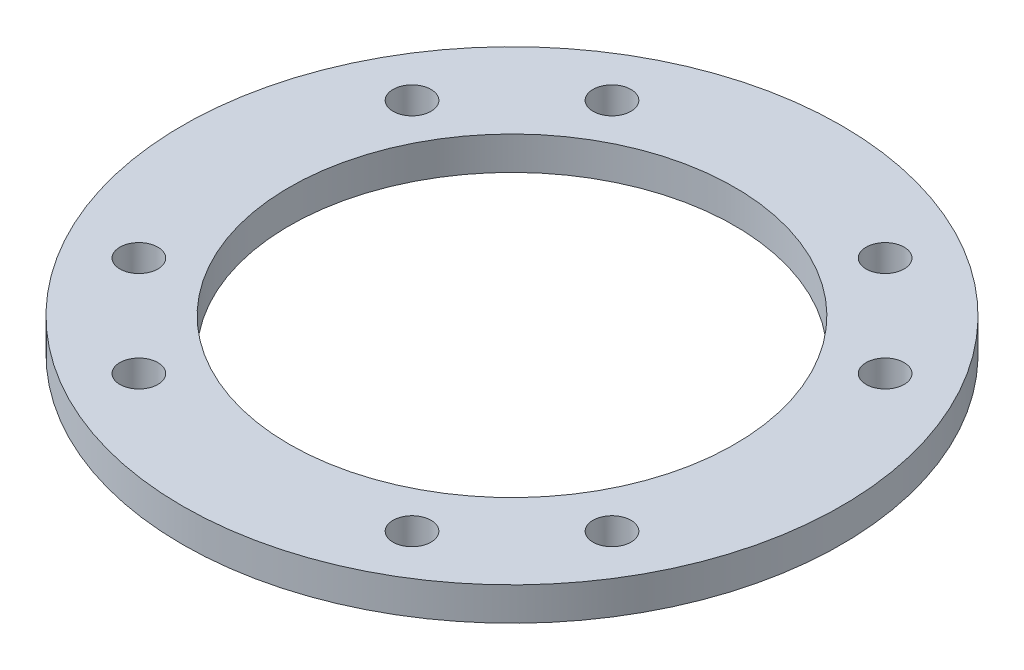
ISO-10303-21;
HEADER;
FILE_DESCRIPTION(('STEP AP214'),'2;1');
FILE_NAME('part.step','',(''),(''),'','','');
FILE_SCHEMA(('AUTOMOTIVE_DESIGN { 1 0 10303 214 1 1 1 1 }'));
ENDSEC;
DATA;
#1=APPLICATION_CONTEXT('core data for automotive mechanical design processes');
#2=APPLICATION_PROTOCOL_DEFINITION('international standard','automotive_design',2000,#1);
#3=PRODUCT_CONTEXT('',#1,'mechanical');
#4=PRODUCT('Part','Part','',(#3));
#5=PRODUCT_RELATED_PRODUCT_CATEGORY('part','',(#4));
#6=PRODUCT_DEFINITION_FORMATION('','',#4);
#7=PRODUCT_DEFINITION_CONTEXT('part definition',#1,'design');
#8=PRODUCT_DEFINITION('design','',#6,#7);
#9=PRODUCT_DEFINITION_SHAPE('','',#8);
#10=(LENGTH_UNIT() NAMED_UNIT(*) SI_UNIT(.MILLI.,.METRE.));
#11=(NAMED_UNIT(*) PLANE_ANGLE_UNIT() SI_UNIT($,.RADIAN.));
#12=(NAMED_UNIT(*) SI_UNIT($,.STERADIAN.) SOLID_ANGLE_UNIT());
#13=UNCERTAINTY_MEASURE_WITH_UNIT(LENGTH_MEASURE(1.E-05),#10,'distance_accuracy_value','');
#14=(GEOMETRIC_REPRESENTATION_CONTEXT(3) GLOBAL_UNCERTAINTY_ASSIGNED_CONTEXT((#13)) GLOBAL_UNIT_ASSIGNED_CONTEXT((#10,
#11,#12)) REPRESENTATION_CONTEXT('',''));
#15=CARTESIAN_POINT('',(0.,0.,0.));
#16=DIRECTION('',(0.,0.,1.));
#17=DIRECTION('',(1.,0.,0.));
#18=AXIS2_PLACEMENT_3D('',#15,#16,#17);
#19=CARTESIAN_POINT('',(0.,-40.6471311900001,0.));
#20=DIRECTION('',(0.,1.,0.));
#21=DIRECTION('',(0.,0.,1.));
#22=AXIS2_PLACEMENT_3D('',#19,#20,#21);
#23=PLANE('',#22);
#24=CARTESIAN_POINT('',(0.,-40.6471311900001,0.));
#25=DIRECTION('',(0.,1.,0.));
#26=DIRECTION('',(0.,0.,1.));
#27=AXIS2_PLACEMENT_3D('',#24,#25,#26);
#28=CIRCLE('',#27,37.5);
#29=CARTESIAN_POINT('',(0.,-40.6471311900001,37.5));
#30=VERTEX_POINT('',#29);
#31=EDGE_CURVE('E101',#30,#30,#28,.T.);
#32=ORIENTED_EDGE('',*,*,#31,.F.);
#33=EDGE_LOOP('',(#32));
#34=FACE_BOUND('',#33,.T.);
#35=CARTESIAN_POINT('',(0.,-40.6471311900001,0.));
#36=DIRECTION('',(0.,1.,0.));
#37=DIRECTION('',(0.,0.,1.));
#38=AXIS2_PLACEMENT_3D('',#35,#36,#37);
#39=CIRCLE('',#38,55.5);
#40=CARTESIAN_POINT('',(0.,-40.6471311900001,55.5));
#41=VERTEX_POINT('',#40);
#42=EDGE_CURVE('E10',#41,#41,#39,.T.);
#43=ORIENTED_EDGE('',*,*,#42,.T.);
#44=EDGE_LOOP('',(#43));
#45=FACE_BOUND('',#44,.T.);
#46=CARTESIAN_POINT('',(-22.9999999999995,-40.6471311900001,-39.8371685740845));
#47=DIRECTION('',(0.,-1.,0.));
#48=DIRECTION('',(0.,0.,-1.));
#49=AXIS2_PLACEMENT_3D('',#46,#47,#48);
#50=CIRCLE('',#49,3.20000000000001);
#51=CARTESIAN_POINT('',(-22.9999999999995,-40.6471311900001,-43.0371685740845));
#52=VERTEX_POINT('',#51);
#53=EDGE_CURVE('E90',#52,#52,#50,.F.);
#54=ORIENTED_EDGE('',*,*,#53,.F.);
#55=EDGE_LOOP('',(#54));
#56=FACE_BOUND('',#55,.T.);
#57=CARTESIAN_POINT('',(-39.8371685740839,-40.6471311900001,-23.0000000000005));
#58=DIRECTION('',(0.,-1.,0.));
#59=DIRECTION('',(0.,0.,-1.));
#60=AXIS2_PLACEMENT_3D('',#57,#58,#59);
#61=CIRCLE('',#60,3.20000000000001);
#62=CARTESIAN_POINT('',(-39.8371685740839,-40.6471311900001,-26.2000000000005));
#63=VERTEX_POINT('',#62);
#64=EDGE_CURVE('E84',#63,#63,#61,.F.);
#65=ORIENTED_EDGE('',*,*,#64,.F.);
#66=EDGE_LOOP('',(#65));
#67=FACE_BOUND('',#66,.T.);
#68=CARTESIAN_POINT('',(-39.8371685740842,-40.6471311900001,22.9999999999999));
#69=DIRECTION('',(0.,-1.,0.));
#70=DIRECTION('',(0.,0.,-1.));
#71=AXIS2_PLACEMENT_3D('',#68,#69,#70);
#72=CIRCLE('',#71,3.20000000000001);
#73=CARTESIAN_POINT('',(-39.8371685740842,-40.6471311900001,19.7999999999999));
#74=VERTEX_POINT('',#73);
#75=EDGE_CURVE('E78',#74,#74,#72,.F.);
#76=ORIENTED_EDGE('',*,*,#75,.F.);
#77=EDGE_LOOP('',(#76));
#78=FACE_BOUND('',#77,.T.);
#79=CARTESIAN_POINT('',(-23.,-40.6471311900001,39.8371685740842));
#80=DIRECTION('',(0.,-1.,0.));
#81=DIRECTION('',(0.,0.,-1.));
#82=AXIS2_PLACEMENT_3D('',#79,#80,#81);
#83=CIRCLE('',#82,3.20000000000001);
#84=CARTESIAN_POINT('',(-19.8,-40.6471311900001,39.8371685740842));
#85=VERTEX_POINT('',#84);
#86=EDGE_CURVE('E72',#85,#85,#83,.F.);
#87=ORIENTED_EDGE('',*,*,#86,.F.);
#88=EDGE_LOOP('',(#87));
#89=FACE_BOUND('',#88,.T.);
#90=CARTESIAN_POINT('',(22.9999999999998,-40.6471311900001,39.8371685740843));
#91=DIRECTION('',(0.,-1.,0.));
#92=DIRECTION('',(0.,0.,-1.));
#93=AXIS2_PLACEMENT_3D('',#90,#91,#92);
#94=CIRCLE('',#93,3.20000000000001);
#95=CARTESIAN_POINT('',(22.9999999999998,-40.6471311900001,36.6371685740843));
#96=VERTEX_POINT('',#95);
#97=EDGE_CURVE('E66',#96,#96,#94,.F.);
#98=ORIENTED_EDGE('',*,*,#97,.F.);
#99=EDGE_LOOP('',(#98));
#100=FACE_BOUND('',#99,.T.);
#101=CARTESIAN_POINT('',(39.8371685740841,-40.6471311900001,23.0000000000002));
#102=DIRECTION('',(0.,-1.,0.));
#103=DIRECTION('',(0.,0.,-1.));
#104=AXIS2_PLACEMENT_3D('',#101,#102,#103);
#105=CIRCLE('',#104,3.20000000000001);
#106=CARTESIAN_POINT('',(39.8371685740841,-40.6471311900001,19.8000000000002));
#107=VERTEX_POINT('',#106);
#108=EDGE_CURVE('E60',#107,#107,#105,.F.);
#109=ORIENTED_EDGE('',*,*,#108,.F.);
#110=EDGE_LOOP('',(#109));
#111=FACE_BOUND('',#110,.T.);
#112=CARTESIAN_POINT('',(39.8371685740843,-40.6471311900001,-22.9999999999999));
#113=DIRECTION('',(0.,-1.,0.));
#114=DIRECTION('',(0.,0.,-1.));
#115=AXIS2_PLACEMENT_3D('',#112,#113,#114);
#116=CIRCLE('',#115,3.20000000000001);
#117=CARTESIAN_POINT('',(39.8371685740843,-40.6471311900001,-26.1999999999999));
#118=VERTEX_POINT('',#117);
#119=EDGE_CURVE('E55',#118,#118,#116,.F.);
#120=ORIENTED_EDGE('',*,*,#119,.F.);
#121=EDGE_LOOP('',(#120));
#122=FACE_BOUND('',#121,.T.);
#123=CARTESIAN_POINT('',(23.0000000000001,-40.6471311900001,-39.8371685740842));
#124=DIRECTION('',(0.,-1.,0.));
#125=DIRECTION('',(0.,0.,-1.));
#126=AXIS2_PLACEMENT_3D('',#123,#124,#125);
#127=CIRCLE('',#126,3.20000000000001);
#128=CARTESIAN_POINT('',(23.0000000000001,-40.6471311900001,-43.0371685740842));
#129=VERTEX_POINT('',#128);
#130=EDGE_CURVE('E47',#129,#129,#127,.F.);
#131=ORIENTED_EDGE('',*,*,#130,.F.);
#132=EDGE_LOOP('',(#131));
#133=FACE_BOUND('',#132,.T.);
#134=ADVANCED_FACE('F37',(#34,#45,#56,#67,#78,#89,#100,#111,#122,#133),#23,.T.);
#135=CARTESIAN_POINT('',(55.5,-46.25,0.));
#136=DIRECTION('',(0.,1.,0.));
#137=DIRECTION('',(0.,0.,1.));
#138=AXIS2_PLACEMENT_3D('',#135,#136,#137);
#139=PLANE('',#138);
#140=CARTESIAN_POINT('',(0.,-46.25,0.));
#141=DIRECTION('',(0.,1.,0.));
#142=DIRECTION('',(0.,0.,1.));
#143=AXIS2_PLACEMENT_3D('',#140,#141,#142);
#144=CIRCLE('',#143,37.5);
#145=CARTESIAN_POINT('',(0.,-46.25,37.5));
#146=VERTEX_POINT('',#145);
#147=EDGE_CURVE('E96',#146,#146,#144,.F.);
#148=ORIENTED_EDGE('',*,*,#147,.F.);
#149=EDGE_LOOP('',(#148));
#150=FACE_BOUND('',#149,.T.);
#151=CARTESIAN_POINT('',(-22.9999999999995,-46.25,-39.8371685740845));
#152=DIRECTION('',(0.,-1.,0.));
#153=DIRECTION('',(0.50000000000001,0.,-0.866025403784433));
#154=AXIS2_PLACEMENT_3D('',#151,#152,#153);
#155=CIRCLE('',#154,3.20000000000001);
#156=CARTESIAN_POINT('',(-21.3999999999994,-46.25,-42.6084498661947));
#157=VERTEX_POINT('',#156);
#158=EDGE_CURVE('E93',#157,#157,#155,.T.);
#159=ORIENTED_EDGE('',*,*,#158,.F.);
#160=EDGE_LOOP('',(#159));
#161=FACE_BOUND('',#160,.T.);
#162=CARTESIAN_POINT('',(-39.8371685740839,-46.25,-23.0000000000005));
#163=DIRECTION('',(0.,-1.,0.));
#164=DIRECTION('',(0.,0.,-1.));
#165=AXIS2_PLACEMENT_3D('',#162,#163,#164);
#166=CIRCLE('',#165,3.20000000000001);
#167=CARTESIAN_POINT('',(-39.8371685740839,-46.25,-26.2000000000005));
#168=VERTEX_POINT('',#167);
#169=EDGE_CURVE('E87',#168,#168,#166,.T.);
#170=ORIENTED_EDGE('',*,*,#169,.F.);
#171=EDGE_LOOP('',(#170));
#172=FACE_BOUND('',#171,.T.);
#173=CARTESIAN_POINT('',(-39.8371685740842,-46.25,22.9999999999999));
#174=DIRECTION('',(0.,-1.,0.));
#175=DIRECTION('',(-0.866025403784438,0.,-0.500000000000001));
#176=AXIS2_PLACEMENT_3D('',#173,#174,#175);
#177=CIRCLE('',#176,3.20000000000001);
#178=CARTESIAN_POINT('',(-42.6084498661944,-46.25,21.3999999999999));
#179=VERTEX_POINT('',#178);
#180=EDGE_CURVE('E81',#179,#179,#177,.T.);
#181=ORIENTED_EDGE('',*,*,#180,.F.);
#182=EDGE_LOOP('',(#181));
#183=FACE_BOUND('',#182,.T.);
#184=CARTESIAN_POINT('',(-23.,-46.25,39.8371685740842));
#185=DIRECTION('',(0.,-1.,0.));
#186=DIRECTION('',(-1.,0.,0.));
#187=AXIS2_PLACEMENT_3D('',#184,#185,#186);
#188=CIRCLE('',#187,3.20000000000001);
#189=CARTESIAN_POINT('',(-19.8,-46.25,39.8371685740842));
#190=VERTEX_POINT('',#189);
#191=EDGE_CURVE('E75',#190,#190,#188,.T.);
#192=ORIENTED_EDGE('',*,*,#191,.F.);
#193=EDGE_LOOP('',(#192));
#194=FACE_BOUND('',#193,.T.);
#195=CARTESIAN_POINT('',(22.9999999999998,-46.25,39.8371685740843));
#196=DIRECTION('',(0.,-1.,0.));
#197=DIRECTION('',(-0.500000000000004,0.,0.866025403784436));
#198=AXIS2_PLACEMENT_3D('',#195,#196,#197);
#199=CIRCLE('',#198,3.20000000000001);
#200=CARTESIAN_POINT('',(21.3999999999998,-46.25,42.6084498661945));
#201=VERTEX_POINT('',#200);
#202=EDGE_CURVE('E69',#201,#201,#199,.T.);
#203=ORIENTED_EDGE('',*,*,#202,.F.);
#204=EDGE_LOOP('',(#203));
#205=FACE_BOUND('',#204,.T.);
#206=CARTESIAN_POINT('',(39.8371685740841,-46.25,23.0000000000002));
#207=DIRECTION('',(0.,-1.,0.));
#208=DIRECTION('',(0.,0.,1.));
#209=AXIS2_PLACEMENT_3D('',#206,#207,#208);
#210=CIRCLE('',#209,3.20000000000001);
#211=CARTESIAN_POINT('',(39.8371685740841,-46.25,26.2000000000002));
#212=VERTEX_POINT('',#211);
#213=EDGE_CURVE('E63',#212,#212,#210,.T.);
#214=ORIENTED_EDGE('',*,*,#213,.F.);
#215=EDGE_LOOP('',(#214));
#216=FACE_BOUND('',#215,.T.);
#217=CARTESIAN_POINT('',(39.8371685740843,-46.25,-22.9999999999999));
#218=DIRECTION('',(0.,-1.,0.));
#219=DIRECTION('',(0.866025403784438,0.,0.500000000000001));
#220=AXIS2_PLACEMENT_3D('',#217,#218,#219);
#221=CIRCLE('',#220,3.20000000000001);
#222=CARTESIAN_POINT('',(42.6084498661945,-46.25,-21.3999999999999));
#223=VERTEX_POINT('',#222);
#224=EDGE_CURVE('E57',#223,#223,#221,.T.);
#225=ORIENTED_EDGE('',*,*,#224,.F.);
#226=EDGE_LOOP('',(#225));
#227=FACE_BOUND('',#226,.T.);
#228=CARTESIAN_POINT('',(23.0000000000001,-46.25,-39.8371685740842));
#229=DIRECTION('',(0.,-1.,0.));
#230=DIRECTION('',(1.,0.,0.));
#231=AXIS2_PLACEMENT_3D('',#228,#229,#230);
#232=CIRCLE('',#231,3.20000000000001);
#233=CARTESIAN_POINT('',(26.2000000000001,-46.25,-39.8371685740842));
#234=VERTEX_POINT('',#233);
#235=EDGE_CURVE('E51',#234,#234,#232,.T.);
#236=ORIENTED_EDGE('',*,*,#235,.F.);
#237=EDGE_LOOP('',(#236));
#238=FACE_BOUND('',#237,.T.);
#239=CARTESIAN_POINT('',(0.,-46.25,0.));
#240=DIRECTION('',(0.,1.,0.));
#241=DIRECTION('',(0.,0.,1.));
#242=AXIS2_PLACEMENT_3D('',#239,#240,#241);
#243=CIRCLE('',#242,55.5);
#244=CARTESIAN_POINT('',(0.,-46.25,55.5));
#245=VERTEX_POINT('',#244);
#246=EDGE_CURVE('E43',#245,#245,#243,.T.);
#247=ORIENTED_EDGE('',*,*,#246,.F.);
#248=EDGE_LOOP('',(#247));
#249=FACE_BOUND('',#248,.T.);
#250=ADVANCED_FACE('F109',(#150,#161,#172,#183,#194,#205,#216,#227,#238,#249),#139,.F.);
#251=CARTESIAN_POINT('',(0.,-40.25,0.));
#252=DIRECTION('',(0.,1.,0.));
#253=DIRECTION('',(0.,0.,1.));
#254=AXIS2_PLACEMENT_3D('',#251,#252,#253);
#255=CYLINDRICAL_SURFACE('',#254,55.5);
#256=ORIENTED_EDGE('',*,*,#42,.F.);
#257=EDGE_LOOP('',(#256));
#258=FACE_BOUND('',#257,.T.);
#259=ORIENTED_EDGE('',*,*,#246,.T.);
#260=EDGE_LOOP('',(#259));
#261=FACE_BOUND('',#260,.T.);
#262=ADVANCED_FACE('F146',(#258,#261),#255,.T.);
#263=CARTESIAN_POINT('',(-23.0000000000001,0.00100000000036876,39.8371685740842));
#264=DIRECTION('',(0.,-1.,0.));
#265=DIRECTION('',(1.,0.,0.));
#266=AXIS2_PLACEMENT_3D('',#263,#264,#265);
#267=CYLINDRICAL_SURFACE('',#266,3.20000000000001);
#268=CARTESIAN_POINT('',(-19.8,-46.25,39.8371685740842));
#269=CARTESIAN_POINT('',(-19.8,-46.1916367832292,39.8371685740842));
#270=CARTESIAN_POINT('',(-19.8,-46.1332735664584,39.8371685740842));
#271=CARTESIAN_POINT('',(-19.8,-46.0165471329167,39.8371685740842));
#272=CARTESIAN_POINT('',(-19.8,-45.9581839161459,39.8371685740842));
#273=CARTESIAN_POINT('',(-19.8,-45.8414574826042,39.8371685740842));
#274=CARTESIAN_POINT('',(-19.8,-45.7830942658334,39.8371685740842));
#275=CARTESIAN_POINT('',(-19.8,-45.6663678322917,39.8371685740842));
#276=CARTESIAN_POINT('',(-19.8,-45.6080046155209,39.8371685740842));
#277=CARTESIAN_POINT('',(-19.8,-45.4912781819792,39.8371685740842));
#278=CARTESIAN_POINT('',(-19.8,-45.4329149652084,39.8371685740842));
#279=CARTESIAN_POINT('',(-19.8,-45.3161885316667,39.8371685740842));
#280=CARTESIAN_POINT('',(-19.8,-45.2578253148959,39.8371685740842));
#281=CARTESIAN_POINT('',(-19.8,-45.1410988813542,39.8371685740842));
#282=CARTESIAN_POINT('',(-19.8,-45.0827356645834,39.8371685740842));
#283=CARTESIAN_POINT('',(-19.8,-44.9660092310417,39.8371685740842));
#284=CARTESIAN_POINT('',(-19.8,-44.9076460142709,39.8371685740842));
#285=CARTESIAN_POINT('',(-19.8,-44.7909195807292,39.8371685740842));
#286=CARTESIAN_POINT('',(-19.8,-44.7325563639584,39.8371685740842));
#287=CARTESIAN_POINT('',(-19.8,-44.6158299304167,39.8371685740842));
#288=CARTESIAN_POINT('',(-19.8,-44.5574667136459,39.8371685740842));
#289=CARTESIAN_POINT('',(-19.8,-44.4407402801042,39.8371685740842));
#290=CARTESIAN_POINT('',(-19.8,-44.3823770633334,39.8371685740842));
#291=CARTESIAN_POINT('',(-19.8,-44.2656506297917,39.8371685740842));
#292=CARTESIAN_POINT('',(-19.8,-44.2072874130209,39.8371685740842));
#293=CARTESIAN_POINT('',(-19.8,-44.0905609794792,39.8371685740842));
#294=CARTESIAN_POINT('',(-19.8,-44.0321977627084,39.8371685740842));
#295=CARTESIAN_POINT('',(-19.8,-43.9154713291667,39.8371685740842));
#296=CARTESIAN_POINT('',(-19.8,-43.8571081123959,39.8371685740842));
#297=CARTESIAN_POINT('',(-19.8,-43.7403816788542,39.8371685740842));
#298=CARTESIAN_POINT('',(-19.8,-43.6820184620834,39.8371685740842));
#299=CARTESIAN_POINT('',(-19.8,-43.5652920285417,39.8371685740842));
#300=CARTESIAN_POINT('',(-19.8,-43.5069288117709,39.8371685740842));
#301=CARTESIAN_POINT('',(-19.8,-43.3902023782292,39.8371685740842));
#302=CARTESIAN_POINT('',(-19.8,-43.3318391614584,39.8371685740842));
#303=CARTESIAN_POINT('',(-19.8,-43.2151127279167,39.8371685740842));
#304=CARTESIAN_POINT('',(-19.8,-43.1567495111459,39.8371685740842));
#305=CARTESIAN_POINT('',(-19.8,-43.0400230776042,39.8371685740842));
#306=CARTESIAN_POINT('',(-19.8,-42.9816598608334,39.8371685740842));
#307=CARTESIAN_POINT('',(-19.8,-42.8649334272917,39.8371685740842));
#308=CARTESIAN_POINT('',(-19.8,-42.8065702105209,39.8371685740842));
#309=CARTESIAN_POINT('',(-19.8,-42.6898437769792,39.8371685740842));
#310=CARTESIAN_POINT('',(-19.8,-42.6314805602084,39.8371685740842));
#311=CARTESIAN_POINT('',(-19.8,-42.5147541266667,39.8371685740842));
#312=CARTESIAN_POINT('',(-19.8,-42.4563909098959,39.8371685740842));
#313=CARTESIAN_POINT('',(-19.8,-42.3396644763542,39.8371685740842));
#314=CARTESIAN_POINT('',(-19.8,-42.2813012595834,39.8371685740842));
#315=CARTESIAN_POINT('',(-19.8,-42.1645748260417,39.8371685740842));
#316=CARTESIAN_POINT('',(-19.8,-42.1062116092709,39.8371685740842));
#317=CARTESIAN_POINT('',(-19.8,-41.9894851757292,39.8371685740842));
#318=CARTESIAN_POINT('',(-19.8,-41.9311219589584,39.8371685740842));
#319=CARTESIAN_POINT('',(-19.8,-41.8143955254167,39.8371685740842));
#320=CARTESIAN_POINT('',(-19.8,-41.7560323086459,39.8371685740842));
#321=CARTESIAN_POINT('',(-19.8,-41.6393058751042,39.8371685740842));
#322=CARTESIAN_POINT('',(-19.8,-41.5809426583334,39.8371685740842));
#323=CARTESIAN_POINT('',(-19.8,-41.4642162247917,39.8371685740842));
#324=CARTESIAN_POINT('',(-19.8,-41.4058530080209,39.8371685740842));
#325=CARTESIAN_POINT('',(-19.8,-41.2891265744792,39.8371685740842));
#326=CARTESIAN_POINT('',(-19.8,-41.2307633577084,39.8371685740842));
#327=CARTESIAN_POINT('',(-19.8,-41.1140369241667,39.8371685740842));
#328=CARTESIAN_POINT('',(-19.8,-41.0556737073959,39.8371685740842));
#329=CARTESIAN_POINT('',(-19.8,-40.9389472738542,39.8371685740842));
#330=CARTESIAN_POINT('',(-19.8,-40.8805840570834,39.8371685740842));
#331=CARTESIAN_POINT('',(-19.8,-40.7638576235417,39.8371685740842));
#332=CARTESIAN_POINT('',(-19.8,-40.7054944067709,39.8371685740842));
#333=CARTESIAN_POINT('',(-19.8,-40.6471311900001,39.8371685740842));
#334=B_SPLINE_CURVE_WITH_KNOTS('',3,(#268,#269,#270,#271,#272,#273,#274,#275,#276,#277,#278,
#279,#280,#281,#282,#283,#284,#285,#286,#287,#288,#289,#290,#291,#292,#293,#294,#295,#296,#297,
#298,#299,#300,#301,#302,#303,#304,#305,#306,#307,#308,#309,#310,#311,#312,#313,#314,#315,#316,
#317,#318,#319,#320,#321,#322,#323,#324,#325,#326,#327,#328,#329,#330,#331,#332,#333),
.UNSPECIFIED.,.F.,.F.,(4,2,2,2,2,2,2,2,2,2,2,2,2,2,2,2,2,2,2,2,2,2,2,2,2,2,2,2,2,2,2,2,4),(0.,
0.175089650312502,0.350179300624996,0.525268950937498,0.700358601249992,0.875448251562494,
1.050537901875,1.22562755218749,1.40071720249999,1.57580685281249,1.75089650312499,
1.92598615343749,2.10107580374999,2.27616545406249,2.45125510437499,2.62634475468748,
2.80143440499998,2.97652405531248,3.15161370562498,3.32670335593748,3.50179300624998,
3.67688265656248,3.85197230687498,4.02706195718747,4.20215160749998,4.37724125781248,
4.55233090812497,4.72742055843747,4.90251020874997,5.07759985906247,5.25268950937497,
5.42777915968747,5.60286880999997),.UNSPECIFIED.);
#335=EDGE_CURVE('BSEAM141',#190,#85,#334,.T.);
#336=ORIENTED_EDGE('',*,*,#191,.T.);
#337=ORIENTED_EDGE('',*,*,#86,.T.);
#338=ORIENTED_EDGE('',*,*,#335,.T.);
#339=ORIENTED_EDGE('',*,*,#335,.F.);
#340=EDGE_LOOP('',(#336,#338,#337,#339));
#341=FACE_BOUND('',#340,.T.);
#342=ADVANCED_FACE('F141',(#341),#267,.F.);
#343=CARTESIAN_POINT('',(-39.8371685740843,0.00100000000040346,22.9999999999999));
#344=DIRECTION('',(0.,-1.,0.));
#345=DIRECTION('',(1.,0.,0.));
#346=AXIS2_PLACEMENT_3D('',#343,#344,#345);
#347=CYLINDRICAL_SURFACE('',#346,3.20000000000001);
#348=ORIENTED_EDGE('',*,*,#180,.T.);
#349=EDGE_LOOP('',(#348));
#350=FACE_BOUND('',#349,.T.);
#351=ORIENTED_EDGE('',*,*,#75,.T.);
#352=EDGE_LOOP('',(#351));
#353=FACE_BOUND('',#352,.T.);
#354=ADVANCED_FACE('F131',(#350,#353),#347,.F.);
#355=CARTESIAN_POINT('',(23.0000000000001,0.00100000000013284,-39.8371685740842));
#356=DIRECTION('',(0.,-1.,0.));
#357=DIRECTION('',(0.,0.,-1.));
#358=AXIS2_PLACEMENT_3D('',#355,#356,#357);
#359=CYLINDRICAL_SURFACE('',#358,3.20000000000001);
#360=ORIENTED_EDGE('',*,*,#235,.T.);
#361=EDGE_LOOP('',(#360));
#362=FACE_BOUND('',#361,.T.);
#363=ORIENTED_EDGE('',*,*,#130,.T.);
#364=EDGE_LOOP('',(#363));
#365=FACE_BOUND('',#364,.T.);
#366=ADVANCED_FACE('F128',(#362,#365),#359,.F.);
#367=CARTESIAN_POINT('',(39.8371685740843,0.00100000000022998,-22.9999999999999));
#368=DIRECTION('',(0.,-1.,0.));
#369=DIRECTION('',(0.,0.,-1.));
#370=AXIS2_PLACEMENT_3D('',#367,#368,#369);
#371=CYLINDRICAL_SURFACE('',#370,3.20000000000001);
#372=ORIENTED_EDGE('',*,*,#224,.T.);
#373=EDGE_LOOP('',(#372));
#374=FACE_BOUND('',#373,.T.);
#375=ORIENTED_EDGE('',*,*,#119,.T.);
#376=EDGE_LOOP('',(#375));
#377=FACE_BOUND('',#376,.T.);
#378=ADVANCED_FACE('F130',(#374,#377),#371,.F.);
#379=CARTESIAN_POINT('',(-39.8371685740839,0.00100000000035488,-23.0000000000005));
#380=DIRECTION('',(0.,-1.,0.));
#381=DIRECTION('',(0.,0.,-1.));
#382=AXIS2_PLACEMENT_3D('',#379,#380,#381);
#383=CYLINDRICAL_SURFACE('',#382,3.20000000000001);
#384=ORIENTED_EDGE('',*,*,#169,.T.);
#385=EDGE_LOOP('',(#384));
#386=FACE_BOUND('',#385,.T.);
#387=ORIENTED_EDGE('',*,*,#64,.T.);
#388=EDGE_LOOP('',(#387));
#389=FACE_BOUND('',#388,.T.);
#390=ADVANCED_FACE('F138',(#386,#389),#383,.F.);
#391=CARTESIAN_POINT('',(-22.9999999999995,0.00100000000028549,-39.8371685740845));
#392=DIRECTION('',(0.,-1.,0.));
#393=DIRECTION('',(0.,0.,-1.));
#394=AXIS2_PLACEMENT_3D('',#391,#392,#393);
#395=CYLINDRICAL_SURFACE('',#394,3.20000000000001);
#396=ORIENTED_EDGE('',*,*,#158,.T.);
#397=EDGE_LOOP('',(#396));
#398=FACE_BOUND('',#397,.T.);
#399=ORIENTED_EDGE('',*,*,#53,.T.);
#400=EDGE_LOOP('',(#399));
#401=FACE_BOUND('',#400,.T.);
#402=ADVANCED_FACE('F175',(#398,#401),#395,.F.);
#403=CARTESIAN_POINT('',(39.8371685740841,0.00100000000041039,23.0000000000002));
#404=DIRECTION('',(0.,-1.,0.));
#405=DIRECTION('',(1.,0.,0.));
#406=AXIS2_PLACEMENT_3D('',#403,#404,#405);
#407=CYLINDRICAL_SURFACE('',#406,3.20000000000001);
#408=ORIENTED_EDGE('',*,*,#213,.T.);
#409=EDGE_LOOP('',(#408));
#410=FACE_BOUND('',#409,.T.);
#411=ORIENTED_EDGE('',*,*,#108,.T.);
#412=EDGE_LOOP('',(#411));
#413=FACE_BOUND('',#412,.T.);
#414=ADVANCED_FACE('F172',(#410,#413),#407,.F.);
#415=CARTESIAN_POINT('',(22.9999999999998,0.00100000000044509,39.8371685740843));
#416=DIRECTION('',(0.,-1.,0.));
#417=DIRECTION('',(1.,0.,0.));
#418=AXIS2_PLACEMENT_3D('',#415,#416,#417);
#419=CYLINDRICAL_SURFACE('',#418,3.20000000000001);
#420=ORIENTED_EDGE('',*,*,#202,.T.);
#421=EDGE_LOOP('',(#420));
#422=FACE_BOUND('',#421,.T.);
#423=ORIENTED_EDGE('',*,*,#97,.T.);
#424=EDGE_LOOP('',(#423));
#425=FACE_BOUND('',#424,.T.);
#426=ADVANCED_FACE('F110',(#422,#425),#419,.F.);
#427=CARTESIAN_POINT('',(0.,-46.2510000000001,0.));
#428=DIRECTION('',(0.,1.,0.));
#429=DIRECTION('',(0.,0.,1.));
#430=AXIS2_PLACEMENT_3D('',#427,#428,#429);
#431=CYLINDRICAL_SURFACE('',#430,37.5);
#432=ORIENTED_EDGE('',*,*,#31,.T.);
#433=EDGE_LOOP('',(#432));
#434=FACE_BOUND('',#433,.T.);
#435=ORIENTED_EDGE('',*,*,#147,.T.);
#436=EDGE_LOOP('',(#435));
#437=FACE_BOUND('',#436,.T.);
#438=ADVANCED_FACE('F105',(#434,#437),#431,.F.);
#439=CLOSED_SHELL('',(#134,#250,#262,#342,#354,#366,#378,#390,#402,#414,#426,#438));
#440=MANIFOLD_SOLID_BREP('B2',#439);
#441=ADVANCED_BREP_SHAPE_REPRESENTATION('',(#18,#440),#14);
#442=SHAPE_DEFINITION_REPRESENTATION(#9,#441);
ENDSEC;
END-ISO-10303-21;
